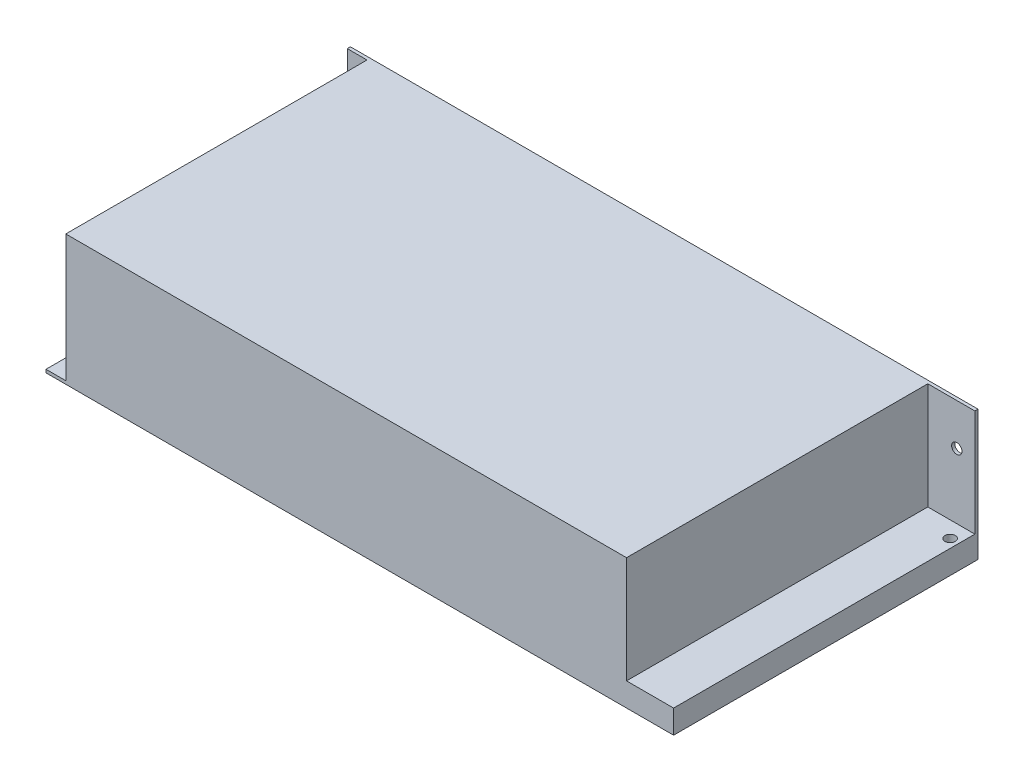
ISO-10303-21;
HEADER;
FILE_DESCRIPTION(('STEP AP214'),'2;1');
FILE_NAME('part.step','',(''),(''),'','','');
FILE_SCHEMA(('AUTOMOTIVE_DESIGN { 1 0 10303 214 1 1 1 1 }'));
ENDSEC;
DATA;
#1=APPLICATION_CONTEXT('core data for automotive mechanical design processes');
#2=APPLICATION_PROTOCOL_DEFINITION('international standard','automotive_design',2000,#1);
#3=PRODUCT_CONTEXT('',#1,'mechanical');
#4=PRODUCT('Part','Part','',(#3));
#5=PRODUCT_RELATED_PRODUCT_CATEGORY('part','',(#4));
#6=PRODUCT_DEFINITION_FORMATION('','',#4);
#7=PRODUCT_DEFINITION_CONTEXT('part definition',#1,'design');
#8=PRODUCT_DEFINITION('design','',#6,#7);
#9=PRODUCT_DEFINITION_SHAPE('','',#8);
#10=(LENGTH_UNIT() NAMED_UNIT(*) SI_UNIT(.MILLI.,.METRE.));
#11=(NAMED_UNIT(*) PLANE_ANGLE_UNIT() SI_UNIT($,.RADIAN.));
#12=(NAMED_UNIT(*) SI_UNIT($,.STERADIAN.) SOLID_ANGLE_UNIT());
#13=UNCERTAINTY_MEASURE_WITH_UNIT(LENGTH_MEASURE(1.E-05),#10,'distance_accuracy_value','');
#14=(GEOMETRIC_REPRESENTATION_CONTEXT(3) GLOBAL_UNCERTAINTY_ASSIGNED_CONTEXT((#13)) GLOBAL_UNIT_ASSIGNED_CONTEXT((#10,
#11,#12)) REPRESENTATION_CONTEXT('',''));
#15=CARTESIAN_POINT('',(0.,0.,0.));
#16=DIRECTION('',(0.,0.,1.));
#17=DIRECTION('',(1.,0.,0.));
#18=AXIS2_PLACEMENT_3D('',#15,#16,#17);
#19=CARTESIAN_POINT('',(-100.,20.75,48.5));
#20=DIRECTION('',(1.,0.,0.));
#21=DIRECTION('',(0.,0.,-1.));
#22=AXIS2_PLACEMENT_3D('',#19,#20,#21);
#23=PLANE('',#22);
#24=DIRECTION('',(0.,1.,0.));
#25=VECTOR('',#24,1.);
#26=CARTESIAN_POINT('',(-100.,-116.956496662128,-47.5));
#27=LINE('',#26,#25);
#28=CARTESIAN_POINT('',(-100.,-19.75,-47.5));
#29=VERTEX_POINT('',#28);
#30=CARTESIAN_POINT('',(-100.,5.95,-47.5));
#31=VERTEX_POINT('',#30);
#32=EDGE_CURVE('E198',#29,#31,#27,.T.);
#33=ORIENTED_EDGE('',*,*,#32,.T.);
#34=DIRECTION('',(0.,0.,1.));
#35=VECTOR('',#34,1.);
#36=CARTESIAN_POINT('',(-100.,5.95,-48.5));
#37=LINE('',#36,#35);
#38=CARTESIAN_POINT('',(-100.,5.95,-48.5));
#39=VERTEX_POINT('',#38);
#40=EDGE_CURVE('E183',#39,#31,#37,.T.);
#41=ORIENTED_EDGE('',*,*,#40,.F.);
#42=DIRECTION('',(0.,-1.,0.));
#43=VECTOR('',#42,1.);
#44=CARTESIAN_POINT('',(-100.,20.75,-48.5));
#45=LINE('',#44,#43);
#46=CARTESIAN_POINT('',(-100.,-20.75,-48.5));
#47=VERTEX_POINT('',#46);
#48=EDGE_CURVE('E259',#39,#47,#45,.T.);
#49=ORIENTED_EDGE('',*,*,#48,.T.);
#50=DIRECTION('',(0.,0.,1.));
#51=VECTOR('',#50,1.);
#52=CARTESIAN_POINT('',(-100.,-20.75,48.5));
#53=LINE('',#52,#51);
#54=CARTESIAN_POINT('',(-100.,-20.75,48.5));
#55=VERTEX_POINT('',#54);
#56=EDGE_CURVE('E251',#47,#55,#53,.T.);
#57=ORIENTED_EDGE('',*,*,#56,.T.);
#58=DIRECTION('',(0.,-1.,0.));
#59=VECTOR('',#58,1.);
#60=CARTESIAN_POINT('',(-100.,20.75,48.5));
#61=LINE('',#60,#59);
#62=CARTESIAN_POINT('',(-100.,-19.75,48.5));
#63=VERTEX_POINT('',#62);
#64=EDGE_CURVE('E257',#63,#55,#61,.T.);
#65=ORIENTED_EDGE('',*,*,#64,.F.);
#66=DIRECTION('',(0.,0.,1.));
#67=VECTOR('',#66,1.);
#68=CARTESIAN_POINT('',(-100.,-19.75,-47.5));
#69=LINE('',#68,#67);
#70=EDGE_CURVE('E195',#29,#63,#69,.T.);
#71=ORIENTED_EDGE('',*,*,#70,.F.);
#72=EDGE_LOOP('',(#33,#41,#49,#57,#65,#71));
#73=FACE_BOUND('',#72,.T.);
#74=ADVANCED_FACE('F47',(#73),#23,.F.);
#75=CARTESIAN_POINT('',(100.,20.75,48.5));
#76=DIRECTION('',(-1.,0.,0.));
#77=DIRECTION('',(0.,0.,1.));
#78=AXIS2_PLACEMENT_3D('',#75,#76,#77);
#79=PLANE('',#78);
#80=DIRECTION('',(0.,1.,0.));
#81=VECTOR('',#80,1.);
#82=CARTESIAN_POINT('',(100.,-117.91480844421,-47.5));
#83=LINE('',#82,#81);
#84=CARTESIAN_POINT('',(100.,-13.25,-47.5));
#85=VERTEX_POINT('',#84);
#86=CARTESIAN_POINT('',(100.,20.75,-47.5));
#87=VERTEX_POINT('',#86);
#88=EDGE_CURVE('E222',#85,#87,#83,.T.);
#89=ORIENTED_EDGE('',*,*,#88,.F.);
#90=DIRECTION('',(0.,0.,-1.));
#91=VECTOR('',#90,1.);
#92=CARTESIAN_POINT('',(100.,-13.25,48.5));
#93=LINE('',#92,#91);
#94=CARTESIAN_POINT('',(100.,-13.25,48.5));
#95=VERTEX_POINT('',#94);
#96=EDGE_CURVE('E219',#95,#85,#93,.T.);
#97=ORIENTED_EDGE('',*,*,#96,.F.);
#98=DIRECTION('',(0.,-1.,0.));
#99=VECTOR('',#98,1.);
#100=CARTESIAN_POINT('',(100.,20.75,48.5));
#101=LINE('',#100,#99);
#102=CARTESIAN_POINT('',(100.,-20.75,48.5));
#103=VERTEX_POINT('',#102);
#104=EDGE_CURVE('E245',#95,#103,#101,.T.);
#105=ORIENTED_EDGE('',*,*,#104,.T.);
#106=DIRECTION('',(0.,0.,-1.));
#107=VECTOR('',#106,1.);
#108=CARTESIAN_POINT('',(100.,-20.75,48.5));
#109=LINE('',#108,#107);
#110=CARTESIAN_POINT('',(100.,-20.75,-48.5));
#111=VERTEX_POINT('',#110);
#112=EDGE_CURVE('E234',#103,#111,#109,.T.);
#113=ORIENTED_EDGE('',*,*,#112,.T.);
#114=DIRECTION('',(0.,-1.,0.));
#115=VECTOR('',#114,1.);
#116=CARTESIAN_POINT('',(100.,20.75,-48.5));
#117=LINE('',#116,#115);
#118=CARTESIAN_POINT('',(100.,20.75,-48.5));
#119=VERTEX_POINT('',#118);
#120=EDGE_CURVE('E12',#119,#111,#117,.T.);
#121=ORIENTED_EDGE('',*,*,#120,.F.);
#122=DIRECTION('',(0.,0.,-1.));
#123=VECTOR('',#122,1.);
#124=CARTESIAN_POINT('',(100.,20.75,48.5));
#125=LINE('',#124,#123);
#126=EDGE_CURVE('E235',#87,#119,#125,.T.);
#127=ORIENTED_EDGE('',*,*,#126,.F.);
#128=EDGE_LOOP('',(#89,#97,#105,#113,#121,#127));
#129=FACE_BOUND('',#128,.T.);
#130=ADVANCED_FACE('F49',(#129),#79,.F.);
#131=CARTESIAN_POINT('',(-100.,20.75,-48.5));
#132=DIRECTION('',(0.,0.,1.));
#133=DIRECTION('',(1.,0.,0.));
#134=AXIS2_PLACEMENT_3D('',#131,#132,#133);
#135=PLANE('',#134);
#136=CARTESIAN_POINT('',(94.25,7.5,-48.5));
#137=DIRECTION('',(0.,0.,1.));
#138=DIRECTION('',(1.,0.,0.));
#139=AXIS2_PLACEMENT_3D('',#136,#137,#138);
#140=CIRCLE('',#139,1.65);
#141=CARTESIAN_POINT('',(95.9,7.5,-48.5));
#142=VERTEX_POINT('',#141);
#143=EDGE_CURVE('E191',#142,#142,#140,.T.);
#144=ORIENTED_EDGE('',*,*,#143,.T.);
#145=EDGE_LOOP('',(#144));
#146=FACE_BOUND('',#145,.T.);
#147=ORIENTED_EDGE('',*,*,#48,.F.);
#148=DIRECTION('',(1.,0.,0.));
#149=VECTOR('',#148,1.);
#150=CARTESIAN_POINT('',(-100.,5.95,-48.5));
#151=LINE('',#150,#149);
#152=CARTESIAN_POINT('',(-96.35,5.95,-48.5));
#153=VERTEX_POINT('',#152);
#154=EDGE_CURVE('E157',#39,#153,#151,.T.);
#155=ORIENTED_EDGE('',*,*,#154,.T.);
#156=CARTESIAN_POINT('',(-96.35,7.6,-48.5));
#157=DIRECTION('',(0.,0.,1.));
#158=DIRECTION('',(1.,0.,0.));
#159=AXIS2_PLACEMENT_3D('',#156,#157,#158);
#160=CIRCLE('',#159,1.65);
#161=CARTESIAN_POINT('',(-96.35,9.25,-48.5));
#162=VERTEX_POINT('',#161);
#163=EDGE_CURVE('E152',#153,#162,#160,.T.);
#164=ORIENTED_EDGE('',*,*,#163,.T.);
#165=DIRECTION('',(-1.,0.,0.));
#166=VECTOR('',#165,1.);
#167=CARTESIAN_POINT('',(-96.35,9.25,-48.5));
#168=LINE('',#167,#166);
#169=CARTESIAN_POINT('',(-100.,9.25,-48.5));
#170=VERTEX_POINT('',#169);
#171=EDGE_CURVE('E160',#162,#170,#168,.T.);
#172=ORIENTED_EDGE('',*,*,#171,.T.);
#173=CARTESIAN_POINT('',(-100.,20.75,-48.5));
#174=VERTEX_POINT('',#173);
#175=EDGE_CURVE('E56',#174,#170,#45,.T.);
#176=ORIENTED_EDGE('',*,*,#175,.F.);
#177=DIRECTION('',(-1.,0.,0.));
#178=VECTOR('',#177,1.);
#179=CARTESIAN_POINT('',(-100.,20.75,-48.5));
#180=LINE('',#179,#178);
#181=EDGE_CURVE('E237',#119,#174,#180,.T.);
#182=ORIENTED_EDGE('',*,*,#181,.F.);
#183=ORIENTED_EDGE('',*,*,#120,.T.);
#184=DIRECTION('',(-1.,0.,0.));
#185=VECTOR('',#184,1.);
#186=CARTESIAN_POINT('',(-100.,-20.75,-48.5));
#187=LINE('',#186,#185);
#188=EDGE_CURVE('E248',#111,#47,#187,.T.);
#189=ORIENTED_EDGE('',*,*,#188,.T.);
#190=EDGE_LOOP('',(#147,#155,#164,#172,#176,#182,#183,#189));
#191=FACE_BOUND('',#190,.T.);
#192=ADVANCED_FACE('F168',(#146,#191),#135,.F.);
#193=ORIENTED_EDGE('',*,*,#175,.T.);
#194=DIRECTION('',(0.,0.,1.));
#195=VECTOR('',#194,1.);
#196=CARTESIAN_POINT('',(-100.,9.25,-48.5));
#197=LINE('',#196,#195);
#198=CARTESIAN_POINT('',(-100.,9.25,-47.5));
#199=VERTEX_POINT('',#198);
#200=EDGE_CURVE('E156',#170,#199,#197,.T.);
#201=ORIENTED_EDGE('',*,*,#200,.T.);
#202=CARTESIAN_POINT('',(-100.,20.75,-47.5));
#203=VERTEX_POINT('',#202);
#204=EDGE_CURVE('E202',#199,#203,#27,.T.);
#205=ORIENTED_EDGE('',*,*,#204,.T.);
#206=DIRECTION('',(0.,0.,1.));
#207=VECTOR('',#206,1.);
#208=CARTESIAN_POINT('',(-100.,20.75,48.5));
#209=LINE('',#208,#207);
#210=EDGE_CURVE('E240',#174,#203,#209,.T.);
#211=ORIENTED_EDGE('',*,*,#210,.F.);
#212=EDGE_LOOP('',(#193,#201,#205,#211));
#213=FACE_BOUND('',#212,.T.);
#214=ADVANCED_FACE('F307',(#213),#23,.F.);
#215=CARTESIAN_POINT('',(-100.,20.75,48.5));
#216=DIRECTION('',(0.,0.,-1.));
#217=DIRECTION('',(-1.,0.,0.));
#218=AXIS2_PLACEMENT_3D('',#215,#216,#217);
#219=PLANE('',#218);
#220=DIRECTION('',(0.,1.,0.));
#221=VECTOR('',#220,1.);
#222=CARTESIAN_POINT('',(-93.6999999999999,-116.956496662128,48.5));
#223=LINE('',#222,#221);
#224=CARTESIAN_POINT('',(-93.6999999999999,-19.75,48.5));
#225=VERTEX_POINT('',#224);
#226=CARTESIAN_POINT('',(-93.6999999999999,20.75,48.5));
#227=VERTEX_POINT('',#226);
#228=EDGE_CURVE('E194',#225,#227,#223,.T.);
#229=ORIENTED_EDGE('',*,*,#228,.F.);
#230=DIRECTION('',(1.,0.,0.));
#231=VECTOR('',#230,1.);
#232=CARTESIAN_POINT('',(-100.,-19.75,48.5));
#233=LINE('',#232,#231);
#234=EDGE_CURVE('E189',#63,#225,#233,.T.);
#235=ORIENTED_EDGE('',*,*,#234,.F.);
#236=ORIENTED_EDGE('',*,*,#64,.T.);
#237=DIRECTION('',(1.,0.,0.));
#238=VECTOR('',#237,1.);
#239=CARTESIAN_POINT('',(-100.,-20.75,48.5));
#240=LINE('',#239,#238);
#241=EDGE_CURVE('E238',#55,#103,#240,.T.);
#242=ORIENTED_EDGE('',*,*,#241,.T.);
#243=ORIENTED_EDGE('',*,*,#104,.F.);
#244=DIRECTION('',(1.,0.,0.));
#245=VECTOR('',#244,1.);
#246=CARTESIAN_POINT('',(100.,-13.25,48.5));
#247=LINE('',#246,#245);
#248=CARTESIAN_POINT('',(85.,-13.25,48.5));
#249=VERTEX_POINT('',#248);
#250=EDGE_CURVE('E223',#249,#95,#247,.T.);
#251=ORIENTED_EDGE('',*,*,#250,.F.);
#252=DIRECTION('',(0.,1.,0.));
#253=VECTOR('',#252,1.);
#254=CARTESIAN_POINT('',(85.,-117.91480844421,48.5));
#255=LINE('',#254,#253);
#256=CARTESIAN_POINT('',(85.,20.75,48.5));
#257=VERTEX_POINT('',#256);
#258=EDGE_CURVE('E225',#249,#257,#255,.T.);
#259=ORIENTED_EDGE('',*,*,#258,.T.);
#260=DIRECTION('',(1.,0.,0.));
#261=VECTOR('',#260,1.);
#262=CARTESIAN_POINT('',(-100.,20.75,48.5));
#263=LINE('',#262,#261);
#264=EDGE_CURVE('E243',#227,#257,#263,.T.);
#265=ORIENTED_EDGE('',*,*,#264,.F.);
#266=EDGE_LOOP('',(#229,#235,#236,#242,#243,#251,#259,#265));
#267=FACE_BOUND('',#266,.T.);
#268=ADVANCED_FACE('F275',(#267),#219,.F.);
#269=CARTESIAN_POINT('',(0.,20.75,0.));
#270=DIRECTION('',(0.,-1.,0.));
#271=DIRECTION('',(0.,0.,-1.));
#272=AXIS2_PLACEMENT_3D('',#269,#270,#271);
#273=PLANE('',#272);
#274=DIRECTION('',(-1.,0.,0.));
#275=VECTOR('',#274,1.);
#276=CARTESIAN_POINT('',(-100.,20.75,-47.5));
#277=LINE('',#276,#275);
#278=CARTESIAN_POINT('',(-93.7,20.75,-47.5));
#279=VERTEX_POINT('',#278);
#280=EDGE_CURVE('E186',#279,#203,#277,.T.);
#281=ORIENTED_EDGE('',*,*,#280,.F.);
#282=DIRECTION('',(0.,0.,-1.));
#283=VECTOR('',#282,1.);
#284=CARTESIAN_POINT('',(-93.7,20.75,-47.5));
#285=LINE('',#284,#283);
#286=EDGE_CURVE('E71',#227,#279,#285,.T.);
#287=ORIENTED_EDGE('',*,*,#286,.F.);
#288=ORIENTED_EDGE('',*,*,#264,.T.);
#289=DIRECTION('',(0.,0.,1.));
#290=VECTOR('',#289,1.);
#291=CARTESIAN_POINT('',(85.,20.75,48.5));
#292=LINE('',#291,#290);
#293=CARTESIAN_POINT('',(85.,20.75,-47.5));
#294=VERTEX_POINT('',#293);
#295=EDGE_CURVE('E211',#294,#257,#292,.T.);
#296=ORIENTED_EDGE('',*,*,#295,.F.);
#297=DIRECTION('',(-1.,0.,0.));
#298=VECTOR('',#297,1.);
#299=CARTESIAN_POINT('',(100.,20.75,-47.5));
#300=LINE('',#299,#298);
#301=EDGE_CURVE('E197',#87,#294,#300,.T.);
#302=ORIENTED_EDGE('',*,*,#301,.F.);
#303=ORIENTED_EDGE('',*,*,#126,.T.);
#304=ORIENTED_EDGE('',*,*,#181,.T.);
#305=ORIENTED_EDGE('',*,*,#210,.T.);
#306=EDGE_LOOP('',(#281,#287,#288,#296,#302,#303,#304,#305));
#307=FACE_BOUND('',#306,.T.);
#308=ADVANCED_FACE('F288',(#307),#273,.F.);
#309=CARTESIAN_POINT('',(0.,-20.75,0.));
#310=DIRECTION('',(0.,-1.,0.));
#311=DIRECTION('',(0.,0.,-1.));
#312=AXIS2_PLACEMENT_3D('',#309,#310,#311);
#313=PLANE('',#312);
#314=CARTESIAN_POINT('',(97.25,-20.75,-42.35));
#315=DIRECTION('',(0.,-1.,0.));
#316=DIRECTION('',(0.,0.,-1.));
#317=AXIS2_PLACEMENT_3D('',#314,#315,#316);
#318=CIRCLE('',#317,1.65);
#319=CARTESIAN_POINT('',(97.25,-20.75,-44.));
#320=VERTEX_POINT('',#319);
#321=EDGE_CURVE('E359',#320,#320,#318,.T.);
#322=ORIENTED_EDGE('',*,*,#321,.F.);
#323=EDGE_LOOP('',(#322));
#324=FACE_BOUND('',#323,.T.);
#325=ORIENTED_EDGE('',*,*,#112,.F.);
#326=ORIENTED_EDGE('',*,*,#241,.F.);
#327=ORIENTED_EDGE('',*,*,#56,.F.);
#328=ORIENTED_EDGE('',*,*,#188,.F.);
#329=EDGE_LOOP('',(#325,#326,#327,#328));
#330=FACE_BOUND('',#329,.T.);
#331=ADVANCED_FACE('F271',(#324,#330),#313,.T.);
#332=CARTESIAN_POINT('',(0.,-13.25,0.));
#333=DIRECTION('',(0.,-1.,0.));
#334=DIRECTION('',(0.,0.,-1.));
#335=AXIS2_PLACEMENT_3D('',#332,#333,#334);
#336=PLANE('',#335);
#337=CARTESIAN_POINT('',(97.25,-13.25,-42.35));
#338=DIRECTION('',(0.,-1.,0.));
#339=DIRECTION('',(0.,0.,-1.));
#340=AXIS2_PLACEMENT_3D('',#337,#338,#339);
#341=CIRCLE('',#340,1.65);
#342=CARTESIAN_POINT('',(97.25,-13.25,-44.));
#343=VERTEX_POINT('',#342);
#344=EDGE_CURVE('E51',#343,#343,#341,.T.);
#345=ORIENTED_EDGE('',*,*,#344,.T.);
#346=EDGE_LOOP('',(#345));
#347=FACE_BOUND('',#346,.T.);
#348=ORIENTED_EDGE('',*,*,#96,.T.);
#349=DIRECTION('',(-1.,0.,0.));
#350=VECTOR('',#349,1.);
#351=CARTESIAN_POINT('',(100.,-13.25,-47.5));
#352=LINE('',#351,#350);
#353=CARTESIAN_POINT('',(85.,-13.25,-47.5));
#354=VERTEX_POINT('',#353);
#355=EDGE_CURVE('E214',#85,#354,#352,.T.);
#356=ORIENTED_EDGE('',*,*,#355,.T.);
#357=DIRECTION('',(0.,0.,1.));
#358=VECTOR('',#357,1.);
#359=CARTESIAN_POINT('',(85.,-13.25,48.5));
#360=LINE('',#359,#358);
#361=EDGE_CURVE('E226',#354,#249,#360,.T.);
#362=ORIENTED_EDGE('',*,*,#361,.T.);
#363=ORIENTED_EDGE('',*,*,#250,.T.);
#364=EDGE_LOOP('',(#348,#356,#362,#363));
#365=FACE_BOUND('',#364,.T.);
#366=ADVANCED_FACE('F294',(#347,#365),#336,.F.);
#367=CARTESIAN_POINT('',(100.,-117.91480844421,-47.5));
#368=DIRECTION('',(0.,0.,-1.));
#369=DIRECTION('',(-1.,0.,0.));
#370=AXIS2_PLACEMENT_3D('',#367,#368,#369);
#371=PLANE('',#370);
#372=CARTESIAN_POINT('',(94.25,7.5,-47.5));
#373=DIRECTION('',(0.,0.,1.));
#374=DIRECTION('',(1.,0.,0.));
#375=AXIS2_PLACEMENT_3D('',#372,#373,#374);
#376=CIRCLE('',#375,1.65);
#377=CARTESIAN_POINT('',(95.9,7.5,-47.5));
#378=VERTEX_POINT('',#377);
#379=EDGE_CURVE('E175',#378,#378,#376,.T.);
#380=ORIENTED_EDGE('',*,*,#379,.F.);
#381=EDGE_LOOP('',(#380));
#382=FACE_BOUND('',#381,.T.);
#383=ORIENTED_EDGE('',*,*,#88,.T.);
#384=ORIENTED_EDGE('',*,*,#301,.T.);
#385=DIRECTION('',(0.,1.,0.));
#386=VECTOR('',#385,1.);
#387=CARTESIAN_POINT('',(85.,-117.91480844421,-47.5));
#388=LINE('',#387,#386);
#389=EDGE_CURVE('E218',#354,#294,#388,.T.);
#390=ORIENTED_EDGE('',*,*,#389,.F.);
#391=ORIENTED_EDGE('',*,*,#355,.F.);
#392=EDGE_LOOP('',(#383,#384,#390,#391));
#393=FACE_BOUND('',#392,.T.);
#394=ADVANCED_FACE('F298',(#382,#393),#371,.F.);
#395=CARTESIAN_POINT('',(85.,-117.91480844421,48.5));
#396=DIRECTION('',(-1.,0.,0.));
#397=DIRECTION('',(0.,0.,1.));
#398=AXIS2_PLACEMENT_3D('',#395,#396,#397);
#399=PLANE('',#398);
#400=ORIENTED_EDGE('',*,*,#389,.T.);
#401=ORIENTED_EDGE('',*,*,#295,.T.);
#402=ORIENTED_EDGE('',*,*,#258,.F.);
#403=ORIENTED_EDGE('',*,*,#361,.F.);
#404=EDGE_LOOP('',(#400,#401,#402,#403));
#405=FACE_BOUND('',#404,.T.);
#406=ADVANCED_FACE('F291',(#405),#399,.F.);
#407=CARTESIAN_POINT('',(0.,-19.75,0.));
#408=DIRECTION('',(0.,-1.,0.));
#409=DIRECTION('',(0.,0.,-1.));
#410=AXIS2_PLACEMENT_3D('',#407,#408,#409);
#411=PLANE('',#410);
#412=ORIENTED_EDGE('',*,*,#70,.T.);
#413=ORIENTED_EDGE('',*,*,#234,.T.);
#414=DIRECTION('',(0.,0.,-1.));
#415=VECTOR('',#414,1.);
#416=CARTESIAN_POINT('',(-93.7,-19.75,-47.5));
#417=LINE('',#416,#415);
#418=CARTESIAN_POINT('',(-93.7,-19.75,-47.5));
#419=VERTEX_POINT('',#418);
#420=EDGE_CURVE('E204',#225,#419,#417,.T.);
#421=ORIENTED_EDGE('',*,*,#420,.T.);
#422=DIRECTION('',(-1.,0.,0.));
#423=VECTOR('',#422,1.);
#424=CARTESIAN_POINT('',(-100.,-19.75,-47.5));
#425=LINE('',#424,#423);
#426=EDGE_CURVE('E199',#419,#29,#425,.T.);
#427=ORIENTED_EDGE('',*,*,#426,.T.);
#428=EDGE_LOOP('',(#412,#413,#421,#427));
#429=FACE_BOUND('',#428,.T.);
#430=ADVANCED_FACE('F280',(#429),#411,.F.);
#431=CARTESIAN_POINT('',(-93.7,-116.956496662128,-47.5));
#432=DIRECTION('',(1.,0.,0.));
#433=DIRECTION('',(0.,0.,-1.));
#434=AXIS2_PLACEMENT_3D('',#431,#432,#433);
#435=PLANE('',#434);
#436=ORIENTED_EDGE('',*,*,#228,.T.);
#437=ORIENTED_EDGE('',*,*,#286,.T.);
#438=DIRECTION('',(0.,1.,0.));
#439=VECTOR('',#438,1.);
#440=CARTESIAN_POINT('',(-93.7,-116.956496662128,-47.5));
#441=LINE('',#440,#439);
#442=EDGE_CURVE('E203',#419,#279,#441,.T.);
#443=ORIENTED_EDGE('',*,*,#442,.F.);
#444=ORIENTED_EDGE('',*,*,#420,.F.);
#445=EDGE_LOOP('',(#436,#437,#443,#444));
#446=FACE_BOUND('',#445,.T.);
#447=ADVANCED_FACE('F285',(#446),#435,.F.);
#448=CARTESIAN_POINT('',(-100.,-116.956496662128,-47.5));
#449=DIRECTION('',(0.,0.,-1.));
#450=DIRECTION('',(-1.,0.,0.));
#451=AXIS2_PLACEMENT_3D('',#448,#449,#450);
#452=PLANE('',#451);
#453=CARTESIAN_POINT('',(-96.35,7.6,-47.5));
#454=DIRECTION('',(0.,0.,1.));
#455=DIRECTION('',(1.,0.,0.));
#456=AXIS2_PLACEMENT_3D('',#453,#454,#455);
#457=CIRCLE('',#456,1.65);
#458=CARTESIAN_POINT('',(-96.35,5.95,-47.5));
#459=VERTEX_POINT('',#458);
#460=CARTESIAN_POINT('',(-96.35,9.24999999999999,-47.5));
#461=VERTEX_POINT('',#460);
#462=EDGE_CURVE('E63',#459,#461,#457,.T.);
#463=ORIENTED_EDGE('',*,*,#462,.F.);
#464=DIRECTION('',(1.,0.,0.));
#465=VECTOR('',#464,1.);
#466=CARTESIAN_POINT('',(-100.,5.95,-47.5));
#467=LINE('',#466,#465);
#468=EDGE_CURVE('E169',#31,#459,#467,.T.);
#469=ORIENTED_EDGE('',*,*,#468,.F.);
#470=ORIENTED_EDGE('',*,*,#32,.F.);
#471=ORIENTED_EDGE('',*,*,#426,.F.);
#472=ORIENTED_EDGE('',*,*,#442,.T.);
#473=ORIENTED_EDGE('',*,*,#280,.T.);
#474=ORIENTED_EDGE('',*,*,#204,.F.);
#475=DIRECTION('',(-1.,0.,0.));
#476=VECTOR('',#475,1.);
#477=CARTESIAN_POINT('',(-96.35,9.25,-47.5));
#478=LINE('',#477,#476);
#479=EDGE_CURVE('E172',#461,#199,#478,.T.);
#480=ORIENTED_EDGE('',*,*,#479,.F.);
#481=EDGE_LOOP('',(#463,#469,#470,#471,#472,#473,#474,#480));
#482=FACE_BOUND('',#481,.T.);
#483=ADVANCED_FACE('F282',(#482),#452,.F.);
#484=CARTESIAN_POINT('',(-96.35,7.6,-48.5));
#485=DIRECTION('',(0.,0.,1.));
#486=DIRECTION('',(1.,0.,0.));
#487=AXIS2_PLACEMENT_3D('',#484,#485,#486);
#488=CYLINDRICAL_SURFACE('',#487,1.65);
#489=ORIENTED_EDGE('',*,*,#462,.T.);
#490=DIRECTION('',(0.,0.,1.));
#491=VECTOR('',#490,1.);
#492=CARTESIAN_POINT('',(-96.35,9.25,-48.5));
#493=LINE('',#492,#491);
#494=EDGE_CURVE('E148',#162,#461,#493,.T.);
#495=ORIENTED_EDGE('',*,*,#494,.F.);
#496=ORIENTED_EDGE('',*,*,#163,.F.);
#497=DIRECTION('',(0.,0.,1.));
#498=VECTOR('',#497,1.);
#499=CARTESIAN_POINT('',(-96.35,5.95,-48.5));
#500=LINE('',#499,#498);
#501=EDGE_CURVE('E181',#153,#459,#500,.T.);
#502=ORIENTED_EDGE('',*,*,#501,.T.);
#503=EDGE_LOOP('',(#489,#495,#496,#502));
#504=FACE_BOUND('',#503,.T.);
#505=ADVANCED_FACE('F150',(#504),#488,.F.);
#506=CARTESIAN_POINT('',(-100.,5.95,-48.5));
#507=DIRECTION('',(0.,-1.,0.));
#508=DIRECTION('',(1.,0.,0.));
#509=AXIS2_PLACEMENT_3D('',#506,#507,#508);
#510=PLANE('',#509);
#511=ORIENTED_EDGE('',*,*,#468,.T.);
#512=ORIENTED_EDGE('',*,*,#501,.F.);
#513=ORIENTED_EDGE('',*,*,#154,.F.);
#514=ORIENTED_EDGE('',*,*,#40,.T.);
#515=EDGE_LOOP('',(#511,#512,#513,#514));
#516=FACE_BOUND('',#515,.T.);
#517=ADVANCED_FACE('F341',(#516),#510,.F.);
#518=CARTESIAN_POINT('',(-96.35,9.25,-48.5));
#519=DIRECTION('',(0.,1.,0.));
#520=DIRECTION('',(0.,0.,1.));
#521=AXIS2_PLACEMENT_3D('',#518,#519,#520);
#522=PLANE('',#521);
#523=ORIENTED_EDGE('',*,*,#479,.T.);
#524=ORIENTED_EDGE('',*,*,#200,.F.);
#525=ORIENTED_EDGE('',*,*,#171,.F.);
#526=ORIENTED_EDGE('',*,*,#494,.T.);
#527=EDGE_LOOP('',(#523,#524,#525,#526));
#528=FACE_BOUND('',#527,.T.);
#529=ADVANCED_FACE('F161',(#528),#522,.F.);
#530=CARTESIAN_POINT('',(94.25,7.5,-48.5));
#531=DIRECTION('',(0.,0.,1.));
#532=DIRECTION('',(1.,0.,0.));
#533=AXIS2_PLACEMENT_3D('',#530,#531,#532);
#534=CYLINDRICAL_SURFACE('',#533,1.65);
#535=ORIENTED_EDGE('',*,*,#143,.F.);
#536=EDGE_LOOP('',(#535));
#537=FACE_BOUND('',#536,.T.);
#538=ORIENTED_EDGE('',*,*,#379,.T.);
#539=EDGE_LOOP('',(#538));
#540=FACE_BOUND('',#539,.T.);
#541=ADVANCED_FACE('F344',(#537,#540),#534,.F.);
#542=CARTESIAN_POINT('',(97.25,20.75,-42.35));
#543=DIRECTION('',(0.,-1.,0.));
#544=DIRECTION('',(0.,0.,-1.));
#545=AXIS2_PLACEMENT_3D('',#542,#543,#544);
#546=CYLINDRICAL_SURFACE('',#545,1.65);
#547=ORIENTED_EDGE('',*,*,#321,.T.);
#548=EDGE_LOOP('',(#547));
#549=FACE_BOUND('',#548,.T.);
#550=ORIENTED_EDGE('',*,*,#344,.F.);
#551=EDGE_LOOP('',(#550));
#552=FACE_BOUND('',#551,.T.);
#553=ADVANCED_FACE('F350',(#549,#552),#546,.F.);
#554=CLOSED_SHELL('',(#74,#130,#192,#214,#268,#308,#331,#366,#394,#406,#430,#447,#483,#505,#517,
#529,#541,#553));
#555=MANIFOLD_SOLID_BREP('B2',#554);
#556=ADVANCED_BREP_SHAPE_REPRESENTATION('',(#18,#555),#14);
#557=SHAPE_DEFINITION_REPRESENTATION(#9,#556);
ENDSEC;
END-ISO-10303-21;
